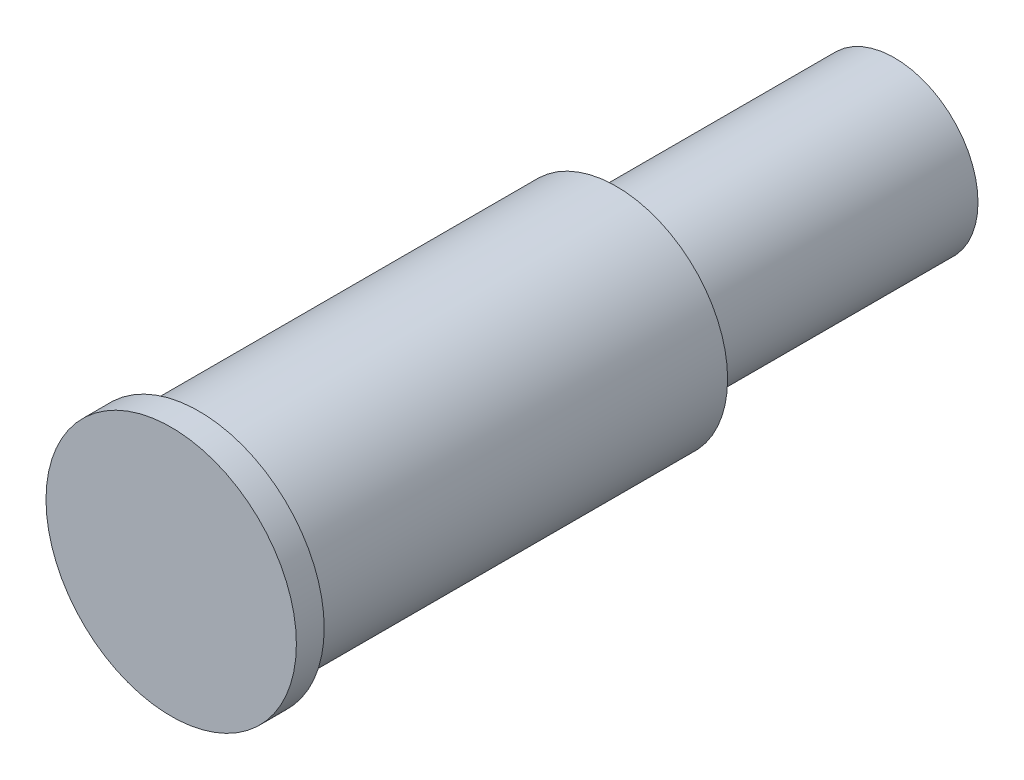
ISO-10303-21;
HEADER;
FILE_DESCRIPTION(('STEP AP214'),'2;1');
FILE_NAME('part.step','',(''),(''),'','','');
FILE_SCHEMA(('AUTOMOTIVE_DESIGN { 1 0 10303 214 1 1 1 1 }'));
ENDSEC;
DATA;
#1=APPLICATION_CONTEXT('core data for automotive mechanical design processes');
#2=APPLICATION_PROTOCOL_DEFINITION('international standard','automotive_design',2000,#1);
#3=PRODUCT_CONTEXT('',#1,'mechanical');
#4=PRODUCT('Part','Part','',(#3));
#5=PRODUCT_RELATED_PRODUCT_CATEGORY('part','',(#4));
#6=PRODUCT_DEFINITION_FORMATION('','',#4);
#7=PRODUCT_DEFINITION_CONTEXT('part definition',#1,'design');
#8=PRODUCT_DEFINITION('design','',#6,#7);
#9=PRODUCT_DEFINITION_SHAPE('','',#8);
#10=(LENGTH_UNIT() NAMED_UNIT(*) SI_UNIT(.MILLI.,.METRE.));
#11=(NAMED_UNIT(*) PLANE_ANGLE_UNIT() SI_UNIT($,.RADIAN.));
#12=(NAMED_UNIT(*) SI_UNIT($,.STERADIAN.) SOLID_ANGLE_UNIT());
#13=UNCERTAINTY_MEASURE_WITH_UNIT(LENGTH_MEASURE(1.E-05),#10,'distance_accuracy_value','');
#14=(GEOMETRIC_REPRESENTATION_CONTEXT(3) GLOBAL_UNCERTAINTY_ASSIGNED_CONTEXT((#13)) GLOBAL_UNIT_ASSIGNED_CONTEXT((#10,
#11,#12)) REPRESENTATION_CONTEXT('',''));
#15=CARTESIAN_POINT('',(0.,0.,0.));
#16=DIRECTION('',(0.,0.,1.));
#17=DIRECTION('',(1.,0.,0.));
#18=AXIS2_PLACEMENT_3D('',#15,#16,#17);
#19=CARTESIAN_POINT('',(0.,0.,10.));
#20=DIRECTION('',(0.,0.,-1.));
#21=DIRECTION('',(-1.,0.,0.));
#22=AXIS2_PLACEMENT_3D('',#19,#20,#21);
#23=CYLINDRICAL_SURFACE('',#22,3.);
#24=CARTESIAN_POINT('',(0.,0.,10.));
#25=DIRECTION('',(0.,0.,1.));
#26=DIRECTION('',(1.,0.,0.));
#27=AXIS2_PLACEMENT_3D('',#24,#25,#26);
#28=CIRCLE('',#27,3.);
#29=CARTESIAN_POINT('',(3.,0.,10.));
#30=VERTEX_POINT('',#29);
#31=EDGE_CURVE('E10',#30,#30,#28,.T.);
#32=ORIENTED_EDGE('',*,*,#31,.F.);
#33=EDGE_LOOP('',(#32));
#34=FACE_BOUND('',#33,.T.);
#35=CARTESIAN_POINT('',(0.,0.,0.));
#36=DIRECTION('',(0.,0.,1.));
#37=DIRECTION('',(1.,0.,0.));
#38=AXIS2_PLACEMENT_3D('',#35,#36,#37);
#39=CIRCLE('',#38,3.);
#40=CARTESIAN_POINT('',(3.,0.,0.));
#41=VERTEX_POINT('',#40);
#42=EDGE_CURVE('E38',#41,#41,#39,.T.);
#43=ORIENTED_EDGE('',*,*,#42,.T.);
#44=EDGE_LOOP('',(#43));
#45=FACE_BOUND('',#44,.T.);
#46=ADVANCED_FACE('F35',(#34,#45),#23,.T.);
#47=CARTESIAN_POINT('',(0.,0.,0.));
#48=DIRECTION('',(0.,0.,1.));
#49=DIRECTION('',(1.,0.,0.));
#50=AXIS2_PLACEMENT_3D('',#47,#48,#49);
#51=PLANE('',#50);
#52=ORIENTED_EDGE('',*,*,#42,.F.);
#53=EDGE_LOOP('',(#52));
#54=FACE_BOUND('',#53,.T.);
#55=ADVANCED_FACE('F77',(#54),#51,.F.);
#56=CARTESIAN_POINT('',(0.,0.,25.));
#57=DIRECTION('',(0.,0.,-1.));
#58=DIRECTION('',(-1.,0.,0.));
#59=AXIS2_PLACEMENT_3D('',#56,#57,#58);
#60=CYLINDRICAL_SURFACE('',#59,4.);
#61=CARTESIAN_POINT('',(0.,0.,25.));
#62=DIRECTION('',(0.,0.,1.));
#63=DIRECTION('',(1.,0.,0.));
#64=AXIS2_PLACEMENT_3D('',#61,#62,#63);
#65=CIRCLE('',#64,4.);
#66=CARTESIAN_POINT('',(4.,0.,25.));
#67=VERTEX_POINT('',#66);
#68=EDGE_CURVE('E45',#67,#67,#65,.T.);
#69=ORIENTED_EDGE('',*,*,#68,.F.);
#70=EDGE_LOOP('',(#69));
#71=FACE_BOUND('',#70,.T.);
#72=CARTESIAN_POINT('',(0.,0.,10.));
#73=DIRECTION('',(0.,0.,1.));
#74=DIRECTION('',(1.,0.,0.));
#75=AXIS2_PLACEMENT_3D('',#72,#73,#74);
#76=CIRCLE('',#75,4.);
#77=CARTESIAN_POINT('',(4.,0.,10.));
#78=VERTEX_POINT('',#77);
#79=EDGE_CURVE('E47',#78,#78,#76,.T.);
#80=ORIENTED_EDGE('',*,*,#79,.T.);
#81=EDGE_LOOP('',(#80));
#82=FACE_BOUND('',#81,.T.);
#83=ADVANCED_FACE('F82',(#71,#82),#60,.T.);
#84=CARTESIAN_POINT('',(0.,0.,10.));
#85=DIRECTION('',(0.,0.,1.));
#86=DIRECTION('',(1.,0.,0.));
#87=AXIS2_PLACEMENT_3D('',#84,#85,#86);
#88=PLANE('',#87);
#89=ORIENTED_EDGE('',*,*,#31,.T.);
#90=EDGE_LOOP('',(#89));
#91=FACE_BOUND('',#90,.T.);
#92=ORIENTED_EDGE('',*,*,#79,.F.);
#93=EDGE_LOOP('',(#92));
#94=FACE_BOUND('',#93,.T.);
#95=ADVANCED_FACE('F64',(#91,#94),#88,.F.);
#96=CARTESIAN_POINT('',(0.,0.,26.));
#97=DIRECTION('',(0.,0.,-1.));
#98=DIRECTION('',(-1.,0.,0.));
#99=AXIS2_PLACEMENT_3D('',#96,#97,#98);
#100=CYLINDRICAL_SURFACE('',#99,4.5);
#101=CARTESIAN_POINT('',(0.,0.,26.));
#102=DIRECTION('',(0.,0.,1.));
#103=DIRECTION('',(1.,0.,0.));
#104=AXIS2_PLACEMENT_3D('',#101,#102,#103);
#105=CIRCLE('',#104,4.5);
#106=CARTESIAN_POINT('',(4.5,0.,26.));
#107=VERTEX_POINT('',#106);
#108=EDGE_CURVE('E50',#107,#107,#105,.T.);
#109=ORIENTED_EDGE('',*,*,#108,.F.);
#110=EDGE_LOOP('',(#109));
#111=FACE_BOUND('',#110,.T.);
#112=CARTESIAN_POINT('',(0.,0.,25.));
#113=DIRECTION('',(0.,0.,1.));
#114=DIRECTION('',(1.,0.,0.));
#115=AXIS2_PLACEMENT_3D('',#112,#113,#114);
#116=CIRCLE('',#115,4.5);
#117=CARTESIAN_POINT('',(4.5,0.,25.));
#118=VERTEX_POINT('',#117);
#119=EDGE_CURVE('E53',#118,#118,#116,.T.);
#120=ORIENTED_EDGE('',*,*,#119,.T.);
#121=EDGE_LOOP('',(#120));
#122=FACE_BOUND('',#121,.T.);
#123=ADVANCED_FACE('F61',(#111,#122),#100,.T.);
#124=CARTESIAN_POINT('',(0.,0.,26.));
#125=DIRECTION('',(0.,0.,1.));
#126=DIRECTION('',(1.,0.,0.));
#127=AXIS2_PLACEMENT_3D('',#124,#125,#126);
#128=PLANE('',#127);
#129=ORIENTED_EDGE('',*,*,#108,.T.);
#130=EDGE_LOOP('',(#129));
#131=FACE_BOUND('',#130,.T.);
#132=ADVANCED_FACE('F59',(#131),#128,.T.);
#133=CARTESIAN_POINT('',(0.,0.,25.));
#134=DIRECTION('',(0.,0.,1.));
#135=DIRECTION('',(1.,0.,0.));
#136=AXIS2_PLACEMENT_3D('',#133,#134,#135);
#137=PLANE('',#136);
#138=ORIENTED_EDGE('',*,*,#68,.T.);
#139=EDGE_LOOP('',(#138));
#140=FACE_BOUND('',#139,.T.);
#141=ORIENTED_EDGE('',*,*,#119,.F.);
#142=EDGE_LOOP('',(#141));
#143=FACE_BOUND('',#142,.T.);
#144=ADVANCED_FACE('F68',(#140,#143),#137,.F.);
#145=CLOSED_SHELL('',(#46,#55,#83,#95,#123,#132,#144));
#146=MANIFOLD_SOLID_BREP('B2',#145);
#147=ADVANCED_BREP_SHAPE_REPRESENTATION('',(#18,#146),#14);
#148=SHAPE_DEFINITION_REPRESENTATION(#9,#147);
ENDSEC;
END-ISO-10303-21;
